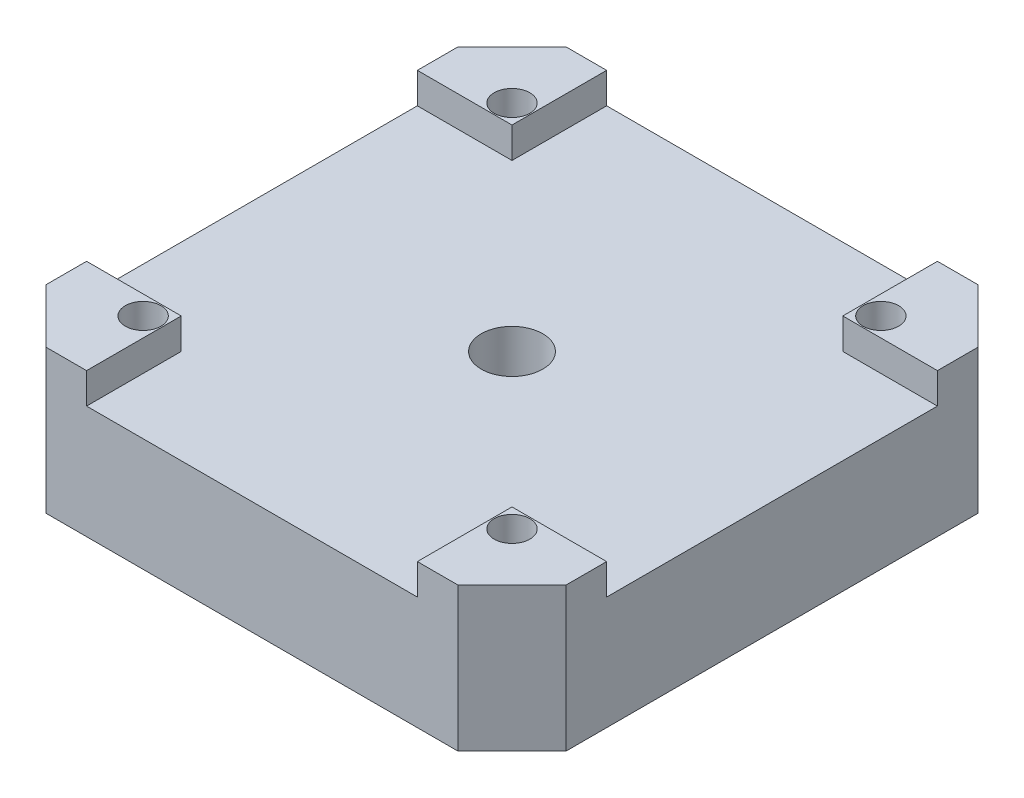
ISO-10303-21;
HEADER;
FILE_DESCRIPTION(('STEP AP214'),'2;1');
FILE_NAME('part.step','',(''),(''),'','','');
FILE_SCHEMA(('AUTOMOTIVE_DESIGN { 1 0 10303 214 1 1 1 1 }'));
ENDSEC;
DATA;
#1=APPLICATION_CONTEXT('core data for automotive mechanical design processes');
#2=APPLICATION_PROTOCOL_DEFINITION('international standard','automotive_design',2000,#1);
#3=PRODUCT_CONTEXT('',#1,'mechanical');
#4=PRODUCT('Part','Part','',(#3));
#5=PRODUCT_RELATED_PRODUCT_CATEGORY('part','',(#4));
#6=PRODUCT_DEFINITION_FORMATION('','',#4);
#7=PRODUCT_DEFINITION_CONTEXT('part definition',#1,'design');
#8=PRODUCT_DEFINITION('design','',#6,#7);
#9=PRODUCT_DEFINITION_SHAPE('','',#8);
#10=(LENGTH_UNIT() NAMED_UNIT(*) SI_UNIT(.MILLI.,.METRE.));
#11=(NAMED_UNIT(*) PLANE_ANGLE_UNIT() SI_UNIT($,.RADIAN.));
#12=(NAMED_UNIT(*) SI_UNIT($,.STERADIAN.) SOLID_ANGLE_UNIT());
#13=UNCERTAINTY_MEASURE_WITH_UNIT(LENGTH_MEASURE(1.E-05),#10,'distance_accuracy_value','');
#14=(GEOMETRIC_REPRESENTATION_CONTEXT(3) GLOBAL_UNCERTAINTY_ASSIGNED_CONTEXT((#13)) GLOBAL_UNIT_ASSIGNED_CONTEXT((#10,
#11,#12)) REPRESENTATION_CONTEXT('',''));
#15=CARTESIAN_POINT('',(0.,0.,0.));
#16=DIRECTION('',(0.,0.,1.));
#17=DIRECTION('',(1.,0.,0.));
#18=AXIS2_PLACEMENT_3D('',#15,#16,#17);
#19=CARTESIAN_POINT('',(0.,11.7,0.));
#20=DIRECTION('',(0.,-1.,0.));
#21=DIRECTION('',(0.,0.,-1.));
#22=AXIS2_PLACEMENT_3D('',#19,#20,#21);
#23=PLANE('',#22);
#24=CARTESIAN_POINT('',(15.,11.7,-15.));
#25=DIRECTION('',(0.,-1.,0.));
#26=DIRECTION('',(0.,0.,-1.));
#27=AXIS2_PLACEMENT_3D('',#24,#25,#26);
#28=CIRCLE('',#27,1.45);
#29=CARTESIAN_POINT('',(15.,11.7,-16.45));
#30=VERTEX_POINT('',#29);
#31=EDGE_CURVE('E472',#30,#30,#28,.T.);
#32=ORIENTED_EDGE('',*,*,#31,.T.);
#33=EDGE_LOOP('',(#32));
#34=FACE_BOUND('',#33,.T.);
#35=DIRECTION('',(-1.,0.,0.));
#36=VECTOR('',#35,1.);
#37=CARTESIAN_POINT('',(-16.750923471599,11.7,-21.15));
#38=LINE('',#37,#36);
#39=CARTESIAN_POINT('',(16.750923471599,11.7,-21.15));
#40=VERTEX_POINT('',#39);
#41=CARTESIAN_POINT('',(13.4509234715989,11.7,-21.15));
#42=VERTEX_POINT('',#41);
#43=EDGE_CURVE('E242',#40,#42,#38,.T.);
#44=ORIENTED_EDGE('',*,*,#43,.T.);
#45=DIRECTION('',(0.,0.,1.));
#46=VECTOR('',#45,1.);
#47=CARTESIAN_POINT('',(13.4509234715989,11.7,-21.15));
#48=LINE('',#47,#46);
#49=CARTESIAN_POINT('',(13.4509234715989,11.7,-13.4509234715989));
#50=VERTEX_POINT('',#49);
#51=EDGE_CURVE('E383',#42,#50,#48,.T.);
#52=ORIENTED_EDGE('',*,*,#51,.T.);
#53=DIRECTION('',(1.,0.,0.));
#54=VECTOR('',#53,1.);
#55=CARTESIAN_POINT('',(-21.15,11.7,-13.4509234715989));
#56=LINE('',#55,#54);
#57=CARTESIAN_POINT('',(21.15,11.7,-13.4509234715989));
#58=VERTEX_POINT('',#57);
#59=EDGE_CURVE('E369',#50,#58,#56,.T.);
#60=ORIENTED_EDGE('',*,*,#59,.T.);
#61=DIRECTION('',(0.,0.,-1.));
#62=VECTOR('',#61,1.);
#63=CARTESIAN_POINT('',(21.15,11.7,16.750923471599));
#64=LINE('',#63,#62);
#65=CARTESIAN_POINT('',(21.15,11.7,-16.7509234715989));
#66=VERTEX_POINT('',#65);
#67=EDGE_CURVE('E354',#58,#66,#64,.T.);
#68=ORIENTED_EDGE('',*,*,#67,.T.);
#69=DIRECTION('',(-0.707106781186542,0.,-0.707106781186553));
#70=VECTOR('',#69,1.);
#71=CARTESIAN_POINT('',(16.750923471599,11.7,-21.15));
#72=LINE('',#71,#70);
#73=EDGE_CURVE('E243',#66,#40,#72,.T.);
#74=ORIENTED_EDGE('',*,*,#73,.T.);
#75=EDGE_LOOP('',(#44,#52,#60,#68,#74));
#76=FACE_BOUND('',#75,.T.);
#77=ADVANCED_FACE('F40',(#34,#76),#23,.F.);
#78=CARTESIAN_POINT('',(15.,11.7,15.));
#79=DIRECTION('',(0.,-1.,0.));
#80=DIRECTION('',(0.,0.,-1.));
#81=AXIS2_PLACEMENT_3D('',#78,#79,#80);
#82=CIRCLE('',#81,1.45);
#83=CARTESIAN_POINT('',(15.,11.7,13.55));
#84=VERTEX_POINT('',#83);
#85=EDGE_CURVE('E487',#84,#84,#82,.T.);
#86=ORIENTED_EDGE('',*,*,#85,.T.);
#87=EDGE_LOOP('',(#86));
#88=FACE_BOUND('',#87,.T.);
#89=DIRECTION('',(1.,0.,0.));
#90=VECTOR('',#89,1.);
#91=CARTESIAN_POINT('',(-21.15,11.7,13.4509234715989));
#92=LINE('',#91,#90);
#93=CARTESIAN_POINT('',(13.4509234715989,11.7,13.4509234715989));
#94=VERTEX_POINT('',#93);
#95=CARTESIAN_POINT('',(21.15,11.7,13.4509234715989));
#96=VERTEX_POINT('',#95);
#97=EDGE_CURVE('E340',#94,#96,#92,.T.);
#98=ORIENTED_EDGE('',*,*,#97,.F.);
#99=CARTESIAN_POINT('',(13.4509234715989,11.7,21.15));
#100=VERTEX_POINT('',#99);
#101=EDGE_CURVE('E387',#94,#100,#48,.T.);
#102=ORIENTED_EDGE('',*,*,#101,.T.);
#103=DIRECTION('',(1.,0.,0.));
#104=VECTOR('',#103,1.);
#105=CARTESIAN_POINT('',(-16.750923471599,11.7,21.15));
#106=LINE('',#105,#104);
#107=CARTESIAN_POINT('',(16.750923471599,11.7,21.15));
#108=VERTEX_POINT('',#107);
#109=EDGE_CURVE('E347',#100,#108,#106,.T.);
#110=ORIENTED_EDGE('',*,*,#109,.T.);
#111=DIRECTION('',(0.707106781186546,0.,-0.707106781186549));
#112=VECTOR('',#111,1.);
#113=CARTESIAN_POINT('',(16.750923471599,11.7,21.15));
#114=LINE('',#113,#112);
#115=CARTESIAN_POINT('',(21.15,11.7,16.750923471599));
#116=VERTEX_POINT('',#115);
#117=EDGE_CURVE('E352',#108,#116,#114,.T.);
#118=ORIENTED_EDGE('',*,*,#117,.T.);
#119=EDGE_CURVE('E250',#116,#96,#64,.T.);
#120=ORIENTED_EDGE('',*,*,#119,.T.);
#121=EDGE_LOOP('',(#98,#102,#110,#118,#120));
#122=FACE_BOUND('',#121,.T.);
#123=ADVANCED_FACE('F555',(#88,#122),#23,.F.);
#124=CARTESIAN_POINT('',(-21.15,9.19999999999999,-13.4509234715989));
#125=DIRECTION('',(0.,0.,-1.));
#126=DIRECTION('',(-1.,0.,0.));
#127=AXIS2_PLACEMENT_3D('',#124,#125,#126);
#128=PLANE('',#127);
#129=ORIENTED_EDGE('',*,*,#59,.F.);
#130=DIRECTION('',(0.,-1.,0.));
#131=VECTOR('',#130,1.);
#132=CARTESIAN_POINT('',(13.4509234715989,9.20000000000001,-13.4509234715989));
#133=LINE('',#132,#131);
#134=CARTESIAN_POINT('',(13.4509234715989,9.19999999999999,-13.4509234715989));
#135=VERTEX_POINT('',#134);
#136=EDGE_CURVE('E392',#50,#135,#133,.T.);
#137=ORIENTED_EDGE('',*,*,#136,.T.);
#138=DIRECTION('',(1.,0.,0.));
#139=VECTOR('',#138,1.);
#140=CARTESIAN_POINT('',(-21.15,9.19999999999999,-13.4509234715989));
#141=LINE('',#140,#139);
#142=CARTESIAN_POINT('',(21.15,9.20000000000001,-13.4509234715989));
#143=VERTEX_POINT('',#142);
#144=EDGE_CURVE('E329',#135,#143,#141,.T.);
#145=ORIENTED_EDGE('',*,*,#144,.T.);
#146=DIRECTION('',(0.,1.,0.));
#147=VECTOR('',#146,1.);
#148=CARTESIAN_POINT('',(21.15,9.20000000000001,-13.4509234715989));
#149=LINE('',#148,#147);
#150=EDGE_CURVE('E394',#143,#58,#149,.T.);
#151=ORIENTED_EDGE('',*,*,#150,.T.);
#152=EDGE_LOOP('',(#129,#137,#145,#151));
#153=FACE_BOUND('',#152,.T.);
#154=ADVANCED_FACE('F391',(#153),#128,.F.);
#155=CARTESIAN_POINT('',(-21.15,11.7,13.4509234715989));
#156=DIRECTION('',(0.,0.,1.));
#157=DIRECTION('',(1.,0.,0.));
#158=AXIS2_PLACEMENT_3D('',#155,#156,#157);
#159=PLANE('',#158);
#160=DIRECTION('',(1.,0.,0.));
#161=VECTOR('',#160,1.);
#162=CARTESIAN_POINT('',(-21.15,9.19999999999999,13.4509234715989));
#163=LINE('',#162,#161);
#164=CARTESIAN_POINT('',(13.4509234715989,9.19999999999999,13.4509234715989));
#165=VERTEX_POINT('',#164);
#166=CARTESIAN_POINT('',(21.15,9.20000000000001,13.4509234715989));
#167=VERTEX_POINT('',#166);
#168=EDGE_CURVE('E330',#165,#167,#163,.T.);
#169=ORIENTED_EDGE('',*,*,#168,.F.);
#170=DIRECTION('',(0.,1.,0.));
#171=VECTOR('',#170,1.);
#172=CARTESIAN_POINT('',(13.4509234715989,11.7,13.4509234715989));
#173=LINE('',#172,#171);
#174=EDGE_CURVE('E11',#165,#94,#173,.T.);
#175=ORIENTED_EDGE('',*,*,#174,.T.);
#176=ORIENTED_EDGE('',*,*,#97,.T.);
#177=DIRECTION('',(0.,-1.,0.));
#178=VECTOR('',#177,1.);
#179=CARTESIAN_POINT('',(21.15,11.7,13.4509234715989));
#180=LINE('',#179,#178);
#181=EDGE_CURVE('E407',#96,#167,#180,.T.);
#182=ORIENTED_EDGE('',*,*,#181,.T.);
#183=EDGE_LOOP('',(#169,#175,#176,#182));
#184=FACE_BOUND('',#183,.T.);
#185=ADVANCED_FACE('F565',(#184),#159,.F.);
#186=CARTESIAN_POINT('',(-15.,11.7,-15.));
#187=DIRECTION('',(0.,-1.,0.));
#188=DIRECTION('',(0.,0.,-1.));
#189=AXIS2_PLACEMENT_3D('',#186,#187,#188);
#190=CIRCLE('',#189,1.45);
#191=CARTESIAN_POINT('',(-15.,11.7,-16.45));
#192=VERTEX_POINT('',#191);
#193=EDGE_CURVE('E456',#192,#192,#190,.T.);
#194=ORIENTED_EDGE('',*,*,#193,.T.);
#195=EDGE_LOOP('',(#194));
#196=FACE_BOUND('',#195,.T.);
#197=CARTESIAN_POINT('',(-21.15,11.7,-13.4509234715989));
#198=VERTEX_POINT('',#197);
#199=CARTESIAN_POINT('',(-13.450923471599,11.7,-13.4509234715989));
#200=VERTEX_POINT('',#199);
#201=EDGE_CURVE('E233',#198,#200,#56,.T.);
#202=ORIENTED_EDGE('',*,*,#201,.T.);
#203=DIRECTION('',(0.,0.,1.));
#204=VECTOR('',#203,1.);
#205=CARTESIAN_POINT('',(-13.450923471599,11.7,-21.15));
#206=LINE('',#205,#204);
#207=CARTESIAN_POINT('',(-13.450923471599,11.7,-21.15));
#208=VERTEX_POINT('',#207);
#209=EDGE_CURVE('E59',#208,#200,#206,.T.);
#210=ORIENTED_EDGE('',*,*,#209,.F.);
#211=CARTESIAN_POINT('',(-16.750923471599,11.7,-21.15));
#212=VERTEX_POINT('',#211);
#213=EDGE_CURVE('E230',#208,#212,#38,.T.);
#214=ORIENTED_EDGE('',*,*,#213,.T.);
#215=DIRECTION('',(-0.707106781186546,0.,0.707106781186549));
#216=VECTOR('',#215,1.);
#217=CARTESIAN_POINT('',(-21.15,11.7,-16.750923471599));
#218=LINE('',#217,#216);
#219=CARTESIAN_POINT('',(-21.15,11.7,-16.750923471599));
#220=VERTEX_POINT('',#219);
#221=EDGE_CURVE('E248',#212,#220,#218,.T.);
#222=ORIENTED_EDGE('',*,*,#221,.T.);
#223=DIRECTION('',(0.,0.,1.));
#224=VECTOR('',#223,1.);
#225=CARTESIAN_POINT('',(-21.15,11.7,16.7509234715989));
#226=LINE('',#225,#224);
#227=EDGE_CURVE('E341',#220,#198,#226,.T.);
#228=ORIENTED_EDGE('',*,*,#227,.T.);
#229=EDGE_LOOP('',(#202,#210,#214,#222,#228));
#230=FACE_BOUND('',#229,.T.);
#231=ADVANCED_FACE('F229',(#196,#230),#23,.F.);
#232=CARTESIAN_POINT('',(-21.15,11.7,16.7509234715989));
#233=DIRECTION('',(1.,0.,0.));
#234=DIRECTION('',(0.,0.,-1.));
#235=AXIS2_PLACEMENT_3D('',#232,#233,#234);
#236=PLANE('',#235);
#237=DIRECTION('',(0.,0.,-1.));
#238=VECTOR('',#237,1.);
#239=CARTESIAN_POINT('',(-21.15,9.19999999999999,13.4509234715989));
#240=LINE('',#239,#238);
#241=CARTESIAN_POINT('',(-21.15,9.19999999999999,13.4509234715989));
#242=VERTEX_POINT('',#241);
#243=CARTESIAN_POINT('',(-21.15,9.19999999999999,-13.4509234715989));
#244=VERTEX_POINT('',#243);
#245=EDGE_CURVE('E326',#242,#244,#240,.T.);
#246=ORIENTED_EDGE('',*,*,#245,.T.);
#247=DIRECTION('',(0.,1.,0.));
#248=VECTOR('',#247,1.);
#249=CARTESIAN_POINT('',(-21.15,9.19999999999999,-13.4509234715989));
#250=LINE('',#249,#248);
#251=EDGE_CURVE('E411',#244,#198,#250,.T.);
#252=ORIENTED_EDGE('',*,*,#251,.T.);
#253=ORIENTED_EDGE('',*,*,#227,.F.);
#254=DIRECTION('',(0.,-1.,0.));
#255=VECTOR('',#254,1.);
#256=CARTESIAN_POINT('',(-21.15,11.7,-16.750923471599));
#257=LINE('',#256,#255);
#258=CARTESIAN_POINT('',(-21.15,0.,-16.750923471599));
#259=VERTEX_POINT('',#258);
#260=EDGE_CURVE('E256',#220,#259,#257,.T.);
#261=ORIENTED_EDGE('',*,*,#260,.T.);
#262=DIRECTION('',(0.,0.,1.));
#263=VECTOR('',#262,1.);
#264=CARTESIAN_POINT('',(-21.15,0.,16.7509234715989));
#265=LINE('',#264,#263);
#266=CARTESIAN_POINT('',(-21.15,0.,16.7509234715989));
#267=VERTEX_POINT('',#266);
#268=EDGE_CURVE('E257',#259,#267,#265,.T.);
#269=ORIENTED_EDGE('',*,*,#268,.T.);
#270=DIRECTION('',(0.,-1.,0.));
#271=VECTOR('',#270,1.);
#272=CARTESIAN_POINT('',(-21.15,11.7,16.7509234715989));
#273=LINE('',#272,#271);
#274=CARTESIAN_POINT('',(-21.15,11.7,16.7509234715989));
#275=VERTEX_POINT('',#274);
#276=EDGE_CURVE('E307',#275,#267,#273,.T.);
#277=ORIENTED_EDGE('',*,*,#276,.F.);
#278=CARTESIAN_POINT('',(-21.15,11.7,13.4509234715989));
#279=VERTEX_POINT('',#278);
#280=EDGE_CURVE('E281',#279,#275,#226,.T.);
#281=ORIENTED_EDGE('',*,*,#280,.F.);
#282=DIRECTION('',(0.,-1.,0.));
#283=VECTOR('',#282,1.);
#284=CARTESIAN_POINT('',(-21.15,11.7,13.4509234715989));
#285=LINE('',#284,#283);
#286=EDGE_CURVE('E402',#279,#242,#285,.T.);
#287=ORIENTED_EDGE('',*,*,#286,.T.);
#288=EDGE_LOOP('',(#246,#252,#253,#261,#269,#277,#281,#287));
#289=FACE_BOUND('',#288,.T.);
#290=ADVANCED_FACE('F42',(#289),#236,.F.);
#291=CARTESIAN_POINT('',(-21.15,11.7,16.7509234715989));
#292=DIRECTION('',(0.707106781186553,0.,-0.707106781186542));
#293=DIRECTION('',(-0.707106781186542,0.,-0.707106781186553));
#294=AXIS2_PLACEMENT_3D('',#291,#292,#293);
#295=PLANE('',#294);
#296=DIRECTION('',(0.707106781186542,0.,0.707106781186553));
#297=VECTOR('',#296,1.);
#298=CARTESIAN_POINT('',(-21.15,0.,16.7509234715989));
#299=LINE('',#298,#297);
#300=CARTESIAN_POINT('',(-16.750923471599,0.,21.15));
#301=VERTEX_POINT('',#300);
#302=EDGE_CURVE('E261',#267,#301,#299,.T.);
#303=ORIENTED_EDGE('',*,*,#302,.T.);
#304=DIRECTION('',(0.,-1.,0.));
#305=VECTOR('',#304,1.);
#306=CARTESIAN_POINT('',(-16.750923471599,11.7,21.15));
#307=LINE('',#306,#305);
#308=CARTESIAN_POINT('',(-16.750923471599,11.7,21.15));
#309=VERTEX_POINT('',#308);
#310=EDGE_CURVE('E303',#309,#301,#307,.T.);
#311=ORIENTED_EDGE('',*,*,#310,.F.);
#312=DIRECTION('',(0.707106781186542,0.,0.707106781186553));
#313=VECTOR('',#312,1.);
#314=CARTESIAN_POINT('',(-21.15,11.7,16.7509234715989));
#315=LINE('',#314,#313);
#316=EDGE_CURVE('E344',#275,#309,#315,.T.);
#317=ORIENTED_EDGE('',*,*,#316,.F.);
#318=ORIENTED_EDGE('',*,*,#276,.T.);
#319=EDGE_LOOP('',(#303,#311,#317,#318));
#320=FACE_BOUND('',#319,.T.);
#321=ADVANCED_FACE('F793',(#320),#295,.F.);
#322=CARTESIAN_POINT('',(-16.750923471599,11.7,21.15));
#323=DIRECTION('',(0.,0.,-1.));
#324=DIRECTION('',(-1.,0.,0.));
#325=AXIS2_PLACEMENT_3D('',#322,#323,#324);
#326=PLANE('',#325);
#327=ORIENTED_EDGE('',*,*,#109,.F.);
#328=DIRECTION('',(0.,1.,0.));
#329=VECTOR('',#328,1.);
#330=CARTESIAN_POINT('',(13.4509234715989,9.19999999999999,21.15));
#331=LINE('',#330,#329);
#332=CARTESIAN_POINT('',(13.4509234715989,9.19999999999999,21.15));
#333=VERTEX_POINT('',#332);
#334=EDGE_CURVE('E225',#333,#100,#331,.T.);
#335=ORIENTED_EDGE('',*,*,#334,.F.);
#336=DIRECTION('',(1.,0.,0.));
#337=VECTOR('',#336,1.);
#338=CARTESIAN_POINT('',(-13.450923471599,9.20000000000001,21.15));
#339=LINE('',#338,#337);
#340=CARTESIAN_POINT('',(-13.450923471599,9.20000000000001,21.15));
#341=VERTEX_POINT('',#340);
#342=EDGE_CURVE('E430',#341,#333,#339,.T.);
#343=ORIENTED_EDGE('',*,*,#342,.F.);
#344=DIRECTION('',(0.,-1.,0.));
#345=VECTOR('',#344,1.);
#346=CARTESIAN_POINT('',(-13.450923471599,11.7,21.15));
#347=LINE('',#346,#345);
#348=CARTESIAN_POINT('',(-13.450923471599,11.7,21.15));
#349=VERTEX_POINT('',#348);
#350=EDGE_CURVE('E433',#349,#341,#347,.T.);
#351=ORIENTED_EDGE('',*,*,#350,.F.);
#352=EDGE_CURVE('E348',#309,#349,#106,.T.);
#353=ORIENTED_EDGE('',*,*,#352,.F.);
#354=ORIENTED_EDGE('',*,*,#310,.T.);
#355=DIRECTION('',(1.,0.,0.));
#356=VECTOR('',#355,1.);
#357=CARTESIAN_POINT('',(-16.750923471599,0.,21.15));
#358=LINE('',#357,#356);
#359=CARTESIAN_POINT('',(16.750923471599,0.,21.15));
#360=VERTEX_POINT('',#359);
#361=EDGE_CURVE('E264',#301,#360,#358,.T.);
#362=ORIENTED_EDGE('',*,*,#361,.T.);
#363=DIRECTION('',(0.,-1.,0.));
#364=VECTOR('',#363,1.);
#365=CARTESIAN_POINT('',(16.750923471599,11.7,21.15));
#366=LINE('',#365,#364);
#367=EDGE_CURVE('E299',#108,#360,#366,.T.);
#368=ORIENTED_EDGE('',*,*,#367,.F.);
#369=EDGE_LOOP('',(#327,#335,#343,#351,#353,#354,#362,#368));
#370=FACE_BOUND('',#369,.T.);
#371=ADVANCED_FACE('F799',(#370),#326,.F.);
#372=CARTESIAN_POINT('',(16.750923471599,11.7,21.15));
#373=DIRECTION('',(-0.707106781186549,0.,-0.707106781186546));
#374=DIRECTION('',(-0.707106781186546,0.,0.707106781186549));
#375=AXIS2_PLACEMENT_3D('',#372,#373,#374);
#376=PLANE('',#375);
#377=DIRECTION('',(0.707106781186546,0.,-0.707106781186549));
#378=VECTOR('',#377,1.);
#379=CARTESIAN_POINT('',(16.750923471599,0.,21.15));
#380=LINE('',#379,#378);
#381=CARTESIAN_POINT('',(21.15,0.,16.750923471599));
#382=VERTEX_POINT('',#381);
#383=EDGE_CURVE('E267',#360,#382,#380,.T.);
#384=ORIENTED_EDGE('',*,*,#383,.T.);
#385=DIRECTION('',(0.,-1.,0.));
#386=VECTOR('',#385,1.);
#387=CARTESIAN_POINT('',(21.15,11.7,16.750923471599));
#388=LINE('',#387,#386);
#389=EDGE_CURVE('E295',#116,#382,#388,.T.);
#390=ORIENTED_EDGE('',*,*,#389,.F.);
#391=ORIENTED_EDGE('',*,*,#117,.F.);
#392=ORIENTED_EDGE('',*,*,#367,.T.);
#393=EDGE_LOOP('',(#384,#390,#391,#392));
#394=FACE_BOUND('',#393,.T.);
#395=ADVANCED_FACE('F806',(#394),#376,.F.);
#396=CARTESIAN_POINT('',(21.15,11.7,16.750923471599));
#397=DIRECTION('',(-1.,0.,0.));
#398=DIRECTION('',(0.,0.,1.));
#399=AXIS2_PLACEMENT_3D('',#396,#397,#398);
#400=PLANE('',#399);
#401=ORIENTED_EDGE('',*,*,#67,.F.);
#402=ORIENTED_EDGE('',*,*,#150,.F.);
#403=DIRECTION('',(0.,0.,-1.));
#404=VECTOR('',#403,1.);
#405=CARTESIAN_POINT('',(21.15,9.20000000000001,13.4509234715989));
#406=LINE('',#405,#404);
#407=EDGE_CURVE('E403',#167,#143,#406,.T.);
#408=ORIENTED_EDGE('',*,*,#407,.F.);
#409=ORIENTED_EDGE('',*,*,#181,.F.);
#410=ORIENTED_EDGE('',*,*,#119,.F.);
#411=ORIENTED_EDGE('',*,*,#389,.T.);
#412=DIRECTION('',(0.,0.,-1.));
#413=VECTOR('',#412,1.);
#414=CARTESIAN_POINT('',(21.15,0.,16.750923471599));
#415=LINE('',#414,#413);
#416=CARTESIAN_POINT('',(21.15,0.,-16.7509234715989));
#417=VERTEX_POINT('',#416);
#418=EDGE_CURVE('E270',#382,#417,#415,.T.);
#419=ORIENTED_EDGE('',*,*,#418,.T.);
#420=DIRECTION('',(0.,-1.,0.));
#421=VECTOR('',#420,1.);
#422=CARTESIAN_POINT('',(21.15,11.7,-16.7509234715989));
#423=LINE('',#422,#421);
#424=EDGE_CURVE('E291',#66,#417,#423,.T.);
#425=ORIENTED_EDGE('',*,*,#424,.F.);
#426=EDGE_LOOP('',(#401,#402,#408,#409,#410,#411,#419,#425));
#427=FACE_BOUND('',#426,.T.);
#428=ADVANCED_FACE('F373',(#427),#400,.F.);
#429=CARTESIAN_POINT('',(16.750923471599,11.7,-21.15));
#430=DIRECTION('',(-0.707106781186553,0.,0.707106781186542));
#431=DIRECTION('',(0.707106781186542,0.,0.707106781186553));
#432=AXIS2_PLACEMENT_3D('',#429,#430,#431);
#433=PLANE('',#432);
#434=DIRECTION('',(-0.707106781186542,0.,-0.707106781186553));
#435=VECTOR('',#434,1.);
#436=CARTESIAN_POINT('',(16.750923471599,0.,-21.15));
#437=LINE('',#436,#435);
#438=CARTESIAN_POINT('',(16.750923471599,0.,-21.15));
#439=VERTEX_POINT('',#438);
#440=EDGE_CURVE('E273',#417,#439,#437,.T.);
#441=ORIENTED_EDGE('',*,*,#440,.T.);
#442=DIRECTION('',(0.,-1.,0.));
#443=VECTOR('',#442,1.);
#444=CARTESIAN_POINT('',(16.750923471599,11.7,-21.15));
#445=LINE('',#444,#443);
#446=EDGE_CURVE('E287',#40,#439,#445,.T.);
#447=ORIENTED_EDGE('',*,*,#446,.F.);
#448=ORIENTED_EDGE('',*,*,#73,.F.);
#449=ORIENTED_EDGE('',*,*,#424,.T.);
#450=EDGE_LOOP('',(#441,#447,#448,#449));
#451=FACE_BOUND('',#450,.T.);
#452=ADVANCED_FACE('F377',(#451),#433,.F.);
#453=CARTESIAN_POINT('',(-16.750923471599,11.7,-21.15));
#454=DIRECTION('',(0.,0.,1.));
#455=DIRECTION('',(1.,0.,0.));
#456=AXIS2_PLACEMENT_3D('',#453,#454,#455);
#457=PLANE('',#456);
#458=DIRECTION('',(1.,0.,0.));
#459=VECTOR('',#458,1.);
#460=CARTESIAN_POINT('',(-13.450923471599,9.20000000000001,-21.15));
#461=LINE('',#460,#459);
#462=CARTESIAN_POINT('',(-13.450923471599,9.20000000000001,-21.15));
#463=VERTEX_POINT('',#462);
#464=CARTESIAN_POINT('',(13.4509234715989,9.19999999999999,-21.15));
#465=VERTEX_POINT('',#464);
#466=EDGE_CURVE('E224',#463,#465,#461,.T.);
#467=ORIENTED_EDGE('',*,*,#466,.T.);
#468=DIRECTION('',(0.,1.,0.));
#469=VECTOR('',#468,1.);
#470=CARTESIAN_POINT('',(13.4509234715989,9.19999999999999,-21.15));
#471=LINE('',#470,#469);
#472=EDGE_CURVE('E382',#465,#42,#471,.T.);
#473=ORIENTED_EDGE('',*,*,#472,.T.);
#474=ORIENTED_EDGE('',*,*,#43,.F.);
#475=ORIENTED_EDGE('',*,*,#446,.T.);
#476=DIRECTION('',(-1.,0.,0.));
#477=VECTOR('',#476,1.);
#478=CARTESIAN_POINT('',(-16.750923471599,0.,-21.15));
#479=LINE('',#478,#477);
#480=CARTESIAN_POINT('',(-16.750923471599,0.,-21.15));
#481=VERTEX_POINT('',#480);
#482=EDGE_CURVE('E276',#439,#481,#479,.T.);
#483=ORIENTED_EDGE('',*,*,#482,.T.);
#484=DIRECTION('',(0.,-1.,0.));
#485=VECTOR('',#484,1.);
#486=CARTESIAN_POINT('',(-16.750923471599,11.7,-21.15));
#487=LINE('',#486,#485);
#488=EDGE_CURVE('E239',#212,#481,#487,.T.);
#489=ORIENTED_EDGE('',*,*,#488,.F.);
#490=ORIENTED_EDGE('',*,*,#213,.F.);
#491=DIRECTION('',(0.,-1.,0.));
#492=VECTOR('',#491,1.);
#493=CARTESIAN_POINT('',(-13.450923471599,11.7,-21.15));
#494=LINE('',#493,#492);
#495=EDGE_CURVE('E215',#208,#463,#494,.T.);
#496=ORIENTED_EDGE('',*,*,#495,.T.);
#497=EDGE_LOOP('',(#467,#473,#474,#475,#483,#489,#490,#496));
#498=FACE_BOUND('',#497,.T.);
#499=ADVANCED_FACE('F237',(#498),#457,.F.);
#500=CARTESIAN_POINT('',(-21.15,11.7,-16.750923471599));
#501=DIRECTION('',(0.707106781186549,0.,0.707106781186546));
#502=DIRECTION('',(0.707106781186546,0.,-0.707106781186549));
#503=AXIS2_PLACEMENT_3D('',#500,#501,#502);
#504=PLANE('',#503);
#505=DIRECTION('',(-0.707106781186546,0.,0.707106781186549));
#506=VECTOR('',#505,1.);
#507=CARTESIAN_POINT('',(-21.15,0.,-16.750923471599));
#508=LINE('',#507,#506);
#509=EDGE_CURVE('E278',#481,#259,#508,.T.);
#510=ORIENTED_EDGE('',*,*,#509,.T.);
#511=ORIENTED_EDGE('',*,*,#260,.F.);
#512=ORIENTED_EDGE('',*,*,#221,.F.);
#513=ORIENTED_EDGE('',*,*,#488,.T.);
#514=EDGE_LOOP('',(#510,#511,#512,#513));
#515=FACE_BOUND('',#514,.T.);
#516=ADVANCED_FACE('F544',(#515),#504,.F.);
#517=CARTESIAN_POINT('',(-15.,11.7,15.));
#518=DIRECTION('',(0.,-1.,0.));
#519=DIRECTION('',(0.,0.,-1.));
#520=AXIS2_PLACEMENT_3D('',#517,#518,#519);
#521=CIRCLE('',#520,1.45);
#522=CARTESIAN_POINT('',(-15.,11.7,13.55));
#523=VERTEX_POINT('',#522);
#524=EDGE_CURVE('E502',#523,#523,#521,.T.);
#525=ORIENTED_EDGE('',*,*,#524,.T.);
#526=EDGE_LOOP('',(#525));
#527=FACE_BOUND('',#526,.T.);
#528=ORIENTED_EDGE('',*,*,#352,.T.);
#529=CARTESIAN_POINT('',(-13.450923471599,11.7,13.4509234715989));
#530=VERTEX_POINT('',#529);
#531=EDGE_CURVE('E235',#530,#349,#206,.T.);
#532=ORIENTED_EDGE('',*,*,#531,.F.);
#533=EDGE_CURVE('E320',#279,#530,#92,.T.);
#534=ORIENTED_EDGE('',*,*,#533,.F.);
#535=ORIENTED_EDGE('',*,*,#280,.T.);
#536=ORIENTED_EDGE('',*,*,#316,.T.);
#537=EDGE_LOOP('',(#528,#532,#534,#535,#536));
#538=FACE_BOUND('',#537,.T.);
#539=ADVANCED_FACE('F525',(#527,#538),#23,.F.);
#540=CARTESIAN_POINT('',(0.,0.,0.));
#541=DIRECTION('',(0.,-1.,0.));
#542=DIRECTION('',(0.,0.,-1.));
#543=AXIS2_PLACEMENT_3D('',#540,#541,#542);
#544=PLANE('',#543);
#545=CARTESIAN_POINT('',(-15.,0.,15.));
#546=DIRECTION('',(0.,-1.,0.));
#547=DIRECTION('',(0.,0.,-1.));
#548=AXIS2_PLACEMENT_3D('',#545,#546,#547);
#549=CIRCLE('',#548,3.);
#550=CARTESIAN_POINT('',(-15.,0.,12.));
#551=VERTEX_POINT('',#550);
#552=EDGE_CURVE('E514',#551,#551,#549,.T.);
#553=ORIENTED_EDGE('',*,*,#552,.F.);
#554=EDGE_LOOP('',(#553));
#555=FACE_BOUND('',#554,.T.);
#556=CARTESIAN_POINT('',(15.,0.,15.));
#557=DIRECTION('',(0.,-1.,0.));
#558=DIRECTION('',(0.,0.,-1.));
#559=AXIS2_PLACEMENT_3D('',#556,#557,#558);
#560=CIRCLE('',#559,3.);
#561=CARTESIAN_POINT('',(15.,0.,12.));
#562=VERTEX_POINT('',#561);
#563=EDGE_CURVE('E499',#562,#562,#560,.T.);
#564=ORIENTED_EDGE('',*,*,#563,.F.);
#565=EDGE_LOOP('',(#564));
#566=FACE_BOUND('',#565,.T.);
#567=CARTESIAN_POINT('',(15.,0.,-15.));
#568=DIRECTION('',(0.,-1.,0.));
#569=DIRECTION('',(0.,0.,-1.));
#570=AXIS2_PLACEMENT_3D('',#567,#568,#569);
#571=CIRCLE('',#570,3.);
#572=CARTESIAN_POINT('',(15.,0.,-18.));
#573=VERTEX_POINT('',#572);
#574=EDGE_CURVE('E483',#573,#573,#571,.T.);
#575=ORIENTED_EDGE('',*,*,#574,.F.);
#576=EDGE_LOOP('',(#575));
#577=FACE_BOUND('',#576,.T.);
#578=CARTESIAN_POINT('',(-15.,0.,-15.));
#579=DIRECTION('',(0.,-1.,0.));
#580=DIRECTION('',(0.,0.,-1.));
#581=AXIS2_PLACEMENT_3D('',#578,#579,#580);
#582=CIRCLE('',#581,3.);
#583=CARTESIAN_POINT('',(-15.,0.,-18.));
#584=VERTEX_POINT('',#583);
#585=EDGE_CURVE('E468',#584,#584,#582,.T.);
#586=ORIENTED_EDGE('',*,*,#585,.F.);
#587=EDGE_LOOP('',(#586));
#588=FACE_BOUND('',#587,.T.);
#589=CARTESIAN_POINT('',(0.,0.,0.));
#590=DIRECTION('',(0.,-1.,0.));
#591=DIRECTION('',(0.,0.,-1.));
#592=AXIS2_PLACEMENT_3D('',#589,#590,#591);
#593=CIRCLE('',#592,3.25);
#594=CARTESIAN_POINT('',(0.,0.,-3.25));
#595=VERTEX_POINT('',#594);
#596=EDGE_CURVE('E441',#595,#595,#593,.T.);
#597=ORIENTED_EDGE('',*,*,#596,.F.);
#598=EDGE_LOOP('',(#597));
#599=FACE_BOUND('',#598,.T.);
#600=ORIENTED_EDGE('',*,*,#268,.F.);
#601=ORIENTED_EDGE('',*,*,#509,.F.);
#602=ORIENTED_EDGE('',*,*,#482,.F.);
#603=ORIENTED_EDGE('',*,*,#440,.F.);
#604=ORIENTED_EDGE('',*,*,#418,.F.);
#605=ORIENTED_EDGE('',*,*,#383,.F.);
#606=ORIENTED_EDGE('',*,*,#361,.F.);
#607=ORIENTED_EDGE('',*,*,#302,.F.);
#608=EDGE_LOOP('',(#600,#601,#602,#603,#604,#605,#606,#607));
#609=FACE_BOUND('',#608,.T.);
#610=ADVANCED_FACE('F521',(#555,#566,#577,#588,#599,#609),#544,.T.);
#611=CARTESIAN_POINT('',(-13.450923471599,9.20000000000001,-13.4509234715989));
#612=VERTEX_POINT('',#611);
#613=EDGE_CURVE('E334',#244,#612,#141,.T.);
#614=ORIENTED_EDGE('',*,*,#613,.T.);
#615=DIRECTION('',(0.,1.,0.));
#616=VECTOR('',#615,1.);
#617=CARTESIAN_POINT('',(-13.450923471599,9.20000000000001,-13.4509234715989));
#618=LINE('',#617,#616);
#619=EDGE_CURVE('E386',#612,#200,#618,.T.);
#620=ORIENTED_EDGE('',*,*,#619,.T.);
#621=ORIENTED_EDGE('',*,*,#201,.F.);
#622=ORIENTED_EDGE('',*,*,#251,.F.);
#623=EDGE_LOOP('',(#614,#620,#621,#622));
#624=FACE_BOUND('',#623,.T.);
#625=ADVANCED_FACE('F524',(#624),#128,.F.);
#626=CARTESIAN_POINT('',(-21.15,9.19999999999999,13.4509234715989));
#627=DIRECTION('',(0.,-1.,0.));
#628=DIRECTION('',(0.,0.,-1.));
#629=AXIS2_PLACEMENT_3D('',#626,#627,#628);
#630=PLANE('',#629);
#631=CARTESIAN_POINT('',(0.,9.19999999999999,0.));
#632=DIRECTION('',(0.,-1.,0.));
#633=DIRECTION('',(0.,0.,-1.));
#634=AXIS2_PLACEMENT_3D('',#631,#632,#633);
#635=CIRCLE('',#634,2.5);
#636=CARTESIAN_POINT('',(0.,9.19999999999999,-2.5));
#637=VERTEX_POINT('',#636);
#638=EDGE_CURVE('E445',#637,#637,#635,.T.);
#639=ORIENTED_EDGE('',*,*,#638,.T.);
#640=EDGE_LOOP('',(#639));
#641=FACE_BOUND('',#640,.T.);
#642=CARTESIAN_POINT('',(-13.450923471599,9.20000000000001,13.4509234715989));
#643=VERTEX_POINT('',#642);
#644=EDGE_CURVE('E317',#242,#643,#163,.T.);
#645=ORIENTED_EDGE('',*,*,#644,.T.);
#646=DIRECTION('',(0.,0.,1.));
#647=VECTOR('',#646,1.);
#648=CARTESIAN_POINT('',(-13.450923471599,9.20000000000001,-21.15));
#649=LINE('',#648,#647);
#650=EDGE_CURVE('E70',#643,#341,#649,.T.);
#651=ORIENTED_EDGE('',*,*,#650,.T.);
#652=ORIENTED_EDGE('',*,*,#342,.T.);
#653=DIRECTION('',(0.,0.,1.));
#654=VECTOR('',#653,1.);
#655=CARTESIAN_POINT('',(13.4509234715989,9.19999999999999,-21.15));
#656=LINE('',#655,#654);
#657=EDGE_CURVE('E424',#165,#333,#656,.T.);
#658=ORIENTED_EDGE('',*,*,#657,.F.);
#659=ORIENTED_EDGE('',*,*,#168,.T.);
#660=ORIENTED_EDGE('',*,*,#407,.T.);
#661=ORIENTED_EDGE('',*,*,#144,.F.);
#662=EDGE_CURVE('E425',#465,#135,#656,.T.);
#663=ORIENTED_EDGE('',*,*,#662,.F.);
#664=ORIENTED_EDGE('',*,*,#466,.F.);
#665=EDGE_CURVE('E218',#463,#612,#649,.T.);
#666=ORIENTED_EDGE('',*,*,#665,.T.);
#667=ORIENTED_EDGE('',*,*,#613,.F.);
#668=ORIENTED_EDGE('',*,*,#245,.F.);
#669=EDGE_LOOP('',(#645,#651,#652,#658,#659,#660,#661,#663,#664,#666,#667,#668));
#670=FACE_BOUND('',#669,.T.);
#671=ADVANCED_FACE('F323',(#641,#670),#630,.F.);
#672=ORIENTED_EDGE('',*,*,#533,.T.);
#673=DIRECTION('',(0.,-1.,0.));
#674=VECTOR('',#673,1.);
#675=CARTESIAN_POINT('',(-13.450923471599,11.7,13.4509234715989));
#676=LINE('',#675,#674);
#677=EDGE_CURVE('E49',#530,#643,#676,.T.);
#678=ORIENTED_EDGE('',*,*,#677,.T.);
#679=ORIENTED_EDGE('',*,*,#644,.F.);
#680=ORIENTED_EDGE('',*,*,#286,.F.);
#681=EDGE_LOOP('',(#672,#678,#679,#680));
#682=FACE_BOUND('',#681,.T.);
#683=ADVANCED_FACE('F316',(#682),#159,.F.);
#684=CARTESIAN_POINT('',(-13.450923471599,11.7,-21.15));
#685=DIRECTION('',(-1.,0.,0.));
#686=DIRECTION('',(0.,0.,1.));
#687=AXIS2_PLACEMENT_3D('',#684,#685,#686);
#688=PLANE('',#687);
#689=ORIENTED_EDGE('',*,*,#531,.T.);
#690=ORIENTED_EDGE('',*,*,#350,.T.);
#691=ORIENTED_EDGE('',*,*,#650,.F.);
#692=ORIENTED_EDGE('',*,*,#677,.F.);
#693=EDGE_LOOP('',(#689,#690,#691,#692));
#694=FACE_BOUND('',#693,.T.);
#695=ADVANCED_FACE('F564',(#694),#688,.F.);
#696=CARTESIAN_POINT('',(13.4509234715989,9.19999999999999,-21.15));
#697=DIRECTION('',(1.,0.,0.));
#698=DIRECTION('',(0.,1.,0.));
#699=AXIS2_PLACEMENT_3D('',#696,#697,#698);
#700=PLANE('',#699);
#701=ORIENTED_EDGE('',*,*,#657,.T.);
#702=ORIENTED_EDGE('',*,*,#334,.T.);
#703=ORIENTED_EDGE('',*,*,#101,.F.);
#704=ORIENTED_EDGE('',*,*,#174,.F.);
#705=EDGE_LOOP('',(#701,#702,#703,#704));
#706=FACE_BOUND('',#705,.T.);
#707=ADVANCED_FACE('F578',(#706),#700,.F.);
#708=ORIENTED_EDGE('',*,*,#51,.F.);
#709=ORIENTED_EDGE('',*,*,#472,.F.);
#710=ORIENTED_EDGE('',*,*,#662,.T.);
#711=ORIENTED_EDGE('',*,*,#136,.F.);
#712=EDGE_LOOP('',(#708,#709,#710,#711));
#713=FACE_BOUND('',#712,.T.);
#714=ADVANCED_FACE('F575',(#713),#700,.F.);
#715=ORIENTED_EDGE('',*,*,#665,.F.);
#716=ORIENTED_EDGE('',*,*,#495,.F.);
#717=ORIENTED_EDGE('',*,*,#209,.T.);
#718=ORIENTED_EDGE('',*,*,#619,.F.);
#719=EDGE_LOOP('',(#715,#716,#717,#718));
#720=FACE_BOUND('',#719,.T.);
#721=ADVANCED_FACE('F216',(#720),#688,.F.);
#722=CARTESIAN_POINT('',(0.,3.,0.));
#723=DIRECTION('',(0.,-1.,0.));
#724=DIRECTION('',(0.,0.,-1.));
#725=AXIS2_PLACEMENT_3D('',#722,#723,#724);
#726=CYLINDRICAL_SURFACE('',#725,3.25);
#727=CARTESIAN_POINT('',(0.,3.,0.));
#728=DIRECTION('',(0.,-1.,0.));
#729=DIRECTION('',(0.,0.,-1.));
#730=AXIS2_PLACEMENT_3D('',#727,#728,#729);
#731=CIRCLE('',#730,3.25);
#732=CARTESIAN_POINT('',(0.,3.,-3.25));
#733=VERTEX_POINT('',#732);
#734=EDGE_CURVE('E436',#733,#733,#731,.T.);
#735=ORIENTED_EDGE('',*,*,#734,.F.);
#736=EDGE_LOOP('',(#735));
#737=FACE_BOUND('',#736,.T.);
#738=ORIENTED_EDGE('',*,*,#596,.T.);
#739=EDGE_LOOP('',(#738));
#740=FACE_BOUND('',#739,.T.);
#741=ADVANCED_FACE('F574',(#737,#740),#726,.F.);
#742=CARTESIAN_POINT('',(0.,3.,0.));
#743=DIRECTION('',(0.,-1.,0.));
#744=DIRECTION('',(0.,0.,-1.));
#745=AXIS2_PLACEMENT_3D('',#742,#743,#744);
#746=PLANE('',#745);
#747=CARTESIAN_POINT('',(0.,3.,0.));
#748=DIRECTION('',(0.,-1.,0.));
#749=DIRECTION('',(0.,0.,-1.));
#750=AXIS2_PLACEMENT_3D('',#747,#748,#749);
#751=CIRCLE('',#750,2.5);
#752=CARTESIAN_POINT('',(0.,3.,-2.5));
#753=VERTEX_POINT('',#752);
#754=EDGE_CURVE('E452',#753,#753,#751,.T.);
#755=ORIENTED_EDGE('',*,*,#754,.F.);
#756=EDGE_LOOP('',(#755));
#757=FACE_BOUND('',#756,.T.);
#758=ORIENTED_EDGE('',*,*,#734,.T.);
#759=EDGE_LOOP('',(#758));
#760=FACE_BOUND('',#759,.T.);
#761=ADVANCED_FACE('F581',(#757,#760),#746,.T.);
#762=CARTESIAN_POINT('',(0.,11.7,0.));
#763=DIRECTION('',(0.,-1.,0.));
#764=DIRECTION('',(0.,0.,-1.));
#765=AXIS2_PLACEMENT_3D('',#762,#763,#764);
#766=CYLINDRICAL_SURFACE('',#765,2.5);
#767=ORIENTED_EDGE('',*,*,#754,.T.);
#768=EDGE_LOOP('',(#767));
#769=FACE_BOUND('',#768,.T.);
#770=ORIENTED_EDGE('',*,*,#638,.F.);
#771=EDGE_LOOP('',(#770));
#772=FACE_BOUND('',#771,.T.);
#773=ADVANCED_FACE('F585',(#769,#772),#766,.F.);
#774=CARTESIAN_POINT('',(-15.,0.,-15.));
#775=DIRECTION('',(0.,-1.,0.));
#776=DIRECTION('',(0.,0.,-1.));
#777=AXIS2_PLACEMENT_3D('',#774,#775,#776);
#778=CYLINDRICAL_SURFACE('',#777,1.45);
#779=ORIENTED_EDGE('',*,*,#193,.F.);
#780=EDGE_LOOP('',(#779));
#781=FACE_BOUND('',#780,.T.);
#782=CARTESIAN_POINT('',(-15.,2.10000000000002,-15.));
#783=DIRECTION('',(0.,-1.,0.));
#784=DIRECTION('',(0.,0.,-1.));
#785=AXIS2_PLACEMENT_3D('',#782,#783,#784);
#786=CIRCLE('',#785,1.45);
#787=CARTESIAN_POINT('',(-15.,2.10000000000002,-16.45));
#788=VERTEX_POINT('',#787);
#789=EDGE_CURVE('E460',#788,#788,#786,.T.);
#790=ORIENTED_EDGE('',*,*,#789,.T.);
#791=EDGE_LOOP('',(#790));
#792=FACE_BOUND('',#791,.T.);
#793=ADVANCED_FACE('F589',(#781,#792),#778,.F.);
#794=CARTESIAN_POINT('',(-13.55,2.10000000000002,-15.));
#795=DIRECTION('',(0.,1.,0.));
#796=DIRECTION('',(0.,0.,1.));
#797=AXIS2_PLACEMENT_3D('',#794,#795,#796);
#798=PLANE('',#797);
#799=ORIENTED_EDGE('',*,*,#789,.F.);
#800=EDGE_LOOP('',(#799));
#801=FACE_BOUND('',#800,.T.);
#802=CARTESIAN_POINT('',(-15.,2.10000000000002,-15.));
#803=DIRECTION('',(0.,-1.,0.));
#804=DIRECTION('',(0.,0.,-1.));
#805=AXIS2_PLACEMENT_3D('',#802,#803,#804);
#806=CIRCLE('',#805,3.);
#807=CARTESIAN_POINT('',(-15.,2.10000000000002,-18.));
#808=VERTEX_POINT('',#807);
#809=EDGE_CURVE('E464',#808,#808,#806,.T.);
#810=ORIENTED_EDGE('',*,*,#809,.T.);
#811=EDGE_LOOP('',(#810));
#812=FACE_BOUND('',#811,.T.);
#813=ADVANCED_FACE('F593',(#801,#812),#798,.F.);
#814=CARTESIAN_POINT('',(-15.,0.,-15.));
#815=DIRECTION('',(0.,-1.,0.));
#816=DIRECTION('',(0.,0.,-1.));
#817=AXIS2_PLACEMENT_3D('',#814,#815,#816);
#818=CYLINDRICAL_SURFACE('',#817,3.);
#819=ORIENTED_EDGE('',*,*,#809,.F.);
#820=EDGE_LOOP('',(#819));
#821=FACE_BOUND('',#820,.T.);
#822=ORIENTED_EDGE('',*,*,#585,.T.);
#823=EDGE_LOOP('',(#822));
#824=FACE_BOUND('',#823,.T.);
#825=ADVANCED_FACE('F597',(#821,#824),#818,.F.);
#826=CARTESIAN_POINT('',(15.,0.,-15.));
#827=DIRECTION('',(0.,-1.,0.));
#828=DIRECTION('',(0.,0.,-1.));
#829=AXIS2_PLACEMENT_3D('',#826,#827,#828);
#830=CYLINDRICAL_SURFACE('',#829,1.45);
#831=ORIENTED_EDGE('',*,*,#31,.F.);
#832=EDGE_LOOP('',(#831));
#833=FACE_BOUND('',#832,.T.);
#834=CARTESIAN_POINT('',(15.,2.09999999999999,-15.));
#835=DIRECTION('',(0.,-1.,0.));
#836=DIRECTION('',(0.,0.,-1.));
#837=AXIS2_PLACEMENT_3D('',#834,#835,#836);
#838=CIRCLE('',#837,1.45);
#839=CARTESIAN_POINT('',(15.,2.09999999999999,-16.45));
#840=VERTEX_POINT('',#839);
#841=EDGE_CURVE('E475',#840,#840,#838,.T.);
#842=ORIENTED_EDGE('',*,*,#841,.T.);
#843=EDGE_LOOP('',(#842));
#844=FACE_BOUND('',#843,.T.);
#845=ADVANCED_FACE('F601',(#833,#844),#830,.F.);
#846=CARTESIAN_POINT('',(16.45,2.09999999999999,-15.));
#847=DIRECTION('',(0.,1.,0.));
#848=DIRECTION('',(0.,0.,1.));
#849=AXIS2_PLACEMENT_3D('',#846,#847,#848);
#850=PLANE('',#849);
#851=ORIENTED_EDGE('',*,*,#841,.F.);
#852=EDGE_LOOP('',(#851));
#853=FACE_BOUND('',#852,.T.);
#854=CARTESIAN_POINT('',(15.,2.09999999999999,-15.));
#855=DIRECTION('',(0.,-1.,0.));
#856=DIRECTION('',(0.,0.,-1.));
#857=AXIS2_PLACEMENT_3D('',#854,#855,#856);
#858=CIRCLE('',#857,3.);
#859=CARTESIAN_POINT('',(15.,2.09999999999999,-18.));
#860=VERTEX_POINT('',#859);
#861=EDGE_CURVE('E479',#860,#860,#858,.T.);
#862=ORIENTED_EDGE('',*,*,#861,.T.);
#863=EDGE_LOOP('',(#862));
#864=FACE_BOUND('',#863,.T.);
#865=ADVANCED_FACE('F605',(#853,#864),#850,.F.);
#866=CARTESIAN_POINT('',(15.,0.,-15.));
#867=DIRECTION('',(0.,-1.,0.));
#868=DIRECTION('',(0.,0.,-1.));
#869=AXIS2_PLACEMENT_3D('',#866,#867,#868);
#870=CYLINDRICAL_SURFACE('',#869,3.);
#871=ORIENTED_EDGE('',*,*,#861,.F.);
#872=EDGE_LOOP('',(#871));
#873=FACE_BOUND('',#872,.T.);
#874=ORIENTED_EDGE('',*,*,#574,.T.);
#875=EDGE_LOOP('',(#874));
#876=FACE_BOUND('',#875,.T.);
#877=ADVANCED_FACE('F609',(#873,#876),#870,.F.);
#878=CARTESIAN_POINT('',(15.,0.,15.));
#879=DIRECTION('',(0.,-1.,0.));
#880=DIRECTION('',(0.,0.,-1.));
#881=AXIS2_PLACEMENT_3D('',#878,#879,#880);
#882=CYLINDRICAL_SURFACE('',#881,1.45);
#883=ORIENTED_EDGE('',*,*,#85,.F.);
#884=EDGE_LOOP('',(#883));
#885=FACE_BOUND('',#884,.T.);
#886=CARTESIAN_POINT('',(15.,2.09999999999999,15.));
#887=DIRECTION('',(0.,-1.,0.));
#888=DIRECTION('',(0.,0.,-1.));
#889=AXIS2_PLACEMENT_3D('',#886,#887,#888);
#890=CIRCLE('',#889,1.45);
#891=CARTESIAN_POINT('',(15.,2.09999999999999,13.55));
#892=VERTEX_POINT('',#891);
#893=EDGE_CURVE('E491',#892,#892,#890,.T.);
#894=ORIENTED_EDGE('',*,*,#893,.T.);
#895=EDGE_LOOP('',(#894));
#896=FACE_BOUND('',#895,.T.);
#897=ADVANCED_FACE('F613',(#885,#896),#882,.F.);
#898=CARTESIAN_POINT('',(16.45,2.09999999999999,15.));
#899=DIRECTION('',(0.,1.,0.));
#900=DIRECTION('',(0.,0.,1.));
#901=AXIS2_PLACEMENT_3D('',#898,#899,#900);
#902=PLANE('',#901);
#903=ORIENTED_EDGE('',*,*,#893,.F.);
#904=EDGE_LOOP('',(#903));
#905=FACE_BOUND('',#904,.T.);
#906=CARTESIAN_POINT('',(15.,2.09999999999999,15.));
#907=DIRECTION('',(0.,-1.,0.));
#908=DIRECTION('',(0.,0.,-1.));
#909=AXIS2_PLACEMENT_3D('',#906,#907,#908);
#910=CIRCLE('',#909,3.);
#911=CARTESIAN_POINT('',(15.,2.09999999999999,12.));
#912=VERTEX_POINT('',#911);
#913=EDGE_CURVE('E495',#912,#912,#910,.T.);
#914=ORIENTED_EDGE('',*,*,#913,.T.);
#915=EDGE_LOOP('',(#914));
#916=FACE_BOUND('',#915,.T.);
#917=ADVANCED_FACE('F617',(#905,#916),#902,.F.);
#918=CARTESIAN_POINT('',(15.,0.,15.));
#919=DIRECTION('',(0.,-1.,0.));
#920=DIRECTION('',(0.,0.,-1.));
#921=AXIS2_PLACEMENT_3D('',#918,#919,#920);
#922=CYLINDRICAL_SURFACE('',#921,3.);
#923=ORIENTED_EDGE('',*,*,#913,.F.);
#924=EDGE_LOOP('',(#923));
#925=FACE_BOUND('',#924,.T.);
#926=ORIENTED_EDGE('',*,*,#563,.T.);
#927=EDGE_LOOP('',(#926));
#928=FACE_BOUND('',#927,.T.);
#929=ADVANCED_FACE('F621',(#925,#928),#922,.F.);
#930=CARTESIAN_POINT('',(-15.,0.,15.));
#931=DIRECTION('',(0.,-1.,0.));
#932=DIRECTION('',(0.,0.,-1.));
#933=AXIS2_PLACEMENT_3D('',#930,#931,#932);
#934=CYLINDRICAL_SURFACE('',#933,1.45);
#935=ORIENTED_EDGE('',*,*,#524,.F.);
#936=EDGE_LOOP('',(#935));
#937=FACE_BOUND('',#936,.T.);
#938=CARTESIAN_POINT('',(-15.,2.10000000000002,15.));
#939=DIRECTION('',(0.,-1.,0.));
#940=DIRECTION('',(0.,0.,-1.));
#941=AXIS2_PLACEMENT_3D('',#938,#939,#940);
#942=CIRCLE('',#941,1.45);
#943=CARTESIAN_POINT('',(-15.,2.10000000000002,13.55));
#944=VERTEX_POINT('',#943);
#945=EDGE_CURVE('E506',#944,#944,#942,.T.);
#946=ORIENTED_EDGE('',*,*,#945,.T.);
#947=EDGE_LOOP('',(#946));
#948=FACE_BOUND('',#947,.T.);
#949=ADVANCED_FACE('F625',(#937,#948),#934,.F.);
#950=CARTESIAN_POINT('',(-13.55,2.10000000000002,15.));
#951=DIRECTION('',(0.,1.,0.));
#952=DIRECTION('',(0.,0.,1.));
#953=AXIS2_PLACEMENT_3D('',#950,#951,#952);
#954=PLANE('',#953);
#955=ORIENTED_EDGE('',*,*,#945,.F.);
#956=EDGE_LOOP('',(#955));
#957=FACE_BOUND('',#956,.T.);
#958=CARTESIAN_POINT('',(-15.,2.10000000000002,15.));
#959=DIRECTION('',(0.,-1.,0.));
#960=DIRECTION('',(0.,0.,-1.));
#961=AXIS2_PLACEMENT_3D('',#958,#959,#960);
#962=CIRCLE('',#961,3.);
#963=CARTESIAN_POINT('',(-15.,2.10000000000002,12.));
#964=VERTEX_POINT('',#963);
#965=EDGE_CURVE('E510',#964,#964,#962,.T.);
#966=ORIENTED_EDGE('',*,*,#965,.T.);
#967=EDGE_LOOP('',(#966));
#968=FACE_BOUND('',#967,.T.);
#969=ADVANCED_FACE('F629',(#957,#968),#954,.F.);
#970=CARTESIAN_POINT('',(-15.,0.,15.));
#971=DIRECTION('',(0.,-1.,0.));
#972=DIRECTION('',(0.,0.,-1.));
#973=AXIS2_PLACEMENT_3D('',#970,#971,#972);
#974=CYLINDRICAL_SURFACE('',#973,3.);
#975=ORIENTED_EDGE('',*,*,#965,.F.);
#976=EDGE_LOOP('',(#975));
#977=FACE_BOUND('',#976,.T.);
#978=ORIENTED_EDGE('',*,*,#552,.T.);
#979=EDGE_LOOP('',(#978));
#980=FACE_BOUND('',#979,.T.);
#981=ADVANCED_FACE('F519',(#977,#980),#974,.F.);
#982=CLOSED_SHELL('',(#77,#123,#154,#185,#231,#290,#321,#371,#395,#428,#452,#499,#516,#539,#610,
#625,#671,#683,#695,#707,#714,#721,#741,#761,#773,#793,#813,#825,#845,#865,#877,#897,#917,#929,
#949,#969,#981));
#983=MANIFOLD_SOLID_BREP('B2',#982);
#984=ADVANCED_BREP_SHAPE_REPRESENTATION('',(#18,#983),#14);
#985=SHAPE_DEFINITION_REPRESENTATION(#9,#984);
ENDSEC;
END-ISO-10303-21;
